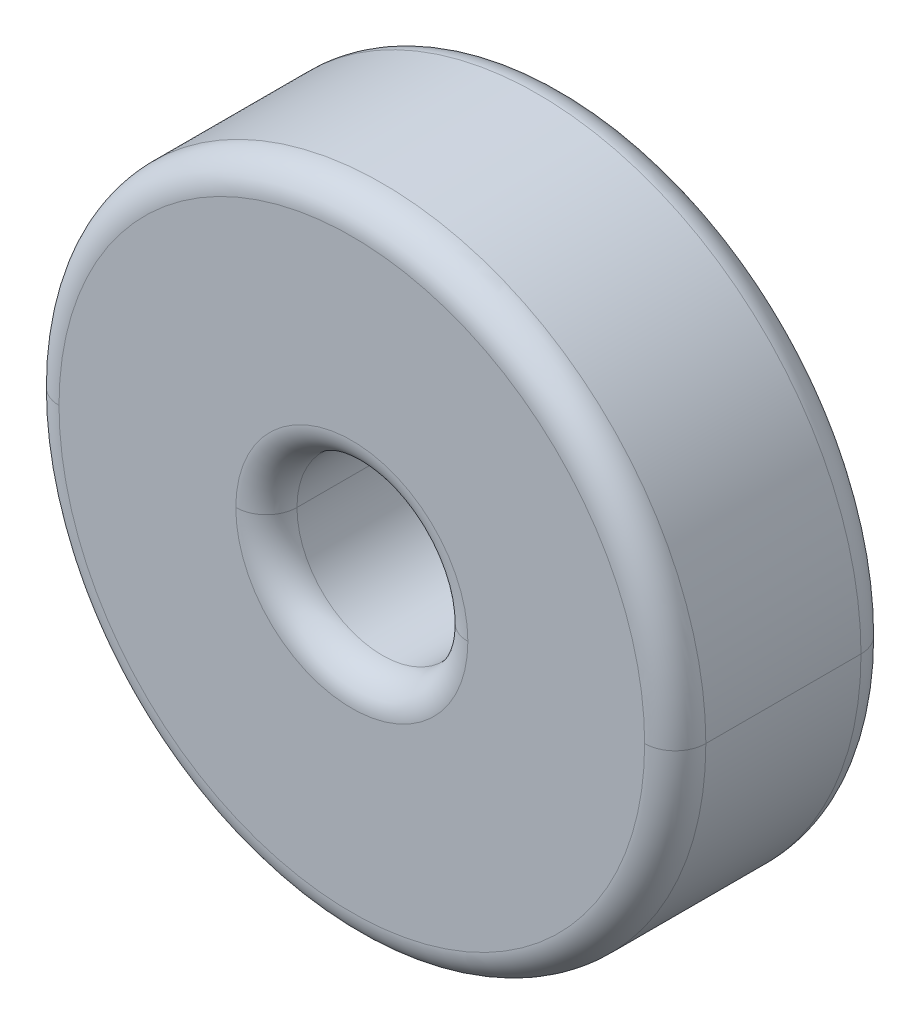
ISO-10303-21;
HEADER;
FILE_DESCRIPTION(('STEP AP214'),'2;1');
FILE_NAME('part.step','',(''),(''),'','','');
FILE_SCHEMA(('AUTOMOTIVE_DESIGN { 1 0 10303 214 1 1 1 1 }'));
ENDSEC;
DATA;
#1=APPLICATION_CONTEXT('core data for automotive mechanical design processes');
#2=APPLICATION_PROTOCOL_DEFINITION('international standard','automotive_design',2000,#1);
#3=PRODUCT_CONTEXT('',#1,'mechanical');
#4=PRODUCT('Part','Part','',(#3));
#5=PRODUCT_RELATED_PRODUCT_CATEGORY('part','',(#4));
#6=PRODUCT_DEFINITION_FORMATION('','',#4);
#7=PRODUCT_DEFINITION_CONTEXT('part definition',#1,'design');
#8=PRODUCT_DEFINITION('design','',#6,#7);
#9=PRODUCT_DEFINITION_SHAPE('','',#8);
#10=(LENGTH_UNIT() NAMED_UNIT(*) SI_UNIT(.MILLI.,.METRE.));
#11=(NAMED_UNIT(*) PLANE_ANGLE_UNIT() SI_UNIT($,.RADIAN.));
#12=(NAMED_UNIT(*) SI_UNIT($,.STERADIAN.) SOLID_ANGLE_UNIT());
#13=UNCERTAINTY_MEASURE_WITH_UNIT(LENGTH_MEASURE(1.E-05),#10,'distance_accuracy_value','');
#14=(GEOMETRIC_REPRESENTATION_CONTEXT(3) GLOBAL_UNCERTAINTY_ASSIGNED_CONTEXT((#13)) GLOBAL_UNIT_ASSIGNED_CONTEXT((#10,
#11,#12)) REPRESENTATION_CONTEXT('',''));
#15=CARTESIAN_POINT('',(0.,0.,0.));
#16=DIRECTION('',(0.,0.,1.));
#17=DIRECTION('',(1.,0.,0.));
#18=AXIS2_PLACEMENT_3D('',#15,#16,#17);
#19=CARTESIAN_POINT('',(0.,0.,5.));
#20=DIRECTION('',(0.,0.,1.));
#21=DIRECTION('',(1.,0.,0.));
#22=AXIS2_PLACEMENT_3D('',#19,#20,#21);
#23=CYLINDRICAL_SURFACE('',#22,1.975);
#24=DIRECTION('',(0.,0.,1.));
#25=VECTOR('',#24,1.);
#26=CARTESIAN_POINT('',(-1.975,0.,5.));
#27=LINE('',#26,#25);
#28=CARTESIAN_POINT('',(-1.975,0.,0.707106781186549));
#29=VERTEX_POINT('',#28);
#30=CARTESIAN_POINT('',(-1.975,0.,4.29289321881346));
#31=VERTEX_POINT('',#30);
#32=EDGE_CURVE('E107',#29,#31,#27,.T.);
#33=ORIENTED_EDGE('',*,*,#32,.F.);
#34=CARTESIAN_POINT('',(0.,0.,0.707106781186549));
#35=DIRECTION('',(0.,0.,1.));
#36=DIRECTION('',(1.,0.,0.));
#37=AXIS2_PLACEMENT_3D('',#34,#35,#36);
#38=CIRCLE('',#37,1.975);
#39=CARTESIAN_POINT('',(1.975,0.,0.707106781186549));
#40=VERTEX_POINT('',#39);
#41=EDGE_CURVE('E21',#40,#29,#38,.T.);
#42=ORIENTED_EDGE('',*,*,#41,.F.);
#43=DIRECTION('',(0.,0.,1.));
#44=VECTOR('',#43,1.);
#45=CARTESIAN_POINT('',(1.975,0.,5.));
#46=LINE('',#45,#44);
#47=CARTESIAN_POINT('',(1.975,0.,4.29289321881346));
#48=VERTEX_POINT('',#47);
#49=EDGE_CURVE('E110',#40,#48,#46,.T.);
#50=ORIENTED_EDGE('',*,*,#49,.T.);
#51=CARTESIAN_POINT('',(0.,0.,4.29289321881346));
#52=DIRECTION('',(0.,0.,1.));
#53=DIRECTION('',(1.,0.,0.));
#54=AXIS2_PLACEMENT_3D('',#51,#52,#53);
#55=CIRCLE('',#54,1.975);
#56=EDGE_CURVE('E103',#48,#31,#55,.T.);
#57=ORIENTED_EDGE('',*,*,#56,.T.);
#58=EDGE_LOOP('',(#33,#42,#50,#57));
#59=FACE_BOUND('',#58,.T.);
#60=ADVANCED_FACE('F17',(#59),#23,.F.);
#61=CARTESIAN_POINT('',(0.,0.,5.));
#62=DIRECTION('',(0.,0.,1.));
#63=DIRECTION('',(0.,-1.,0.));
#64=AXIS2_PLACEMENT_3D('',#61,#62,#63);
#65=PLANE('',#64);
#66=CARTESIAN_POINT('',(0.,0.,5.));
#67=DIRECTION('',(0.,0.,1.));
#68=DIRECTION('',(1.,0.,0.));
#69=AXIS2_PLACEMENT_3D('',#66,#67,#68);
#70=CIRCLE('',#69,2.68210678118655);
#71=CARTESIAN_POINT('',(2.68210678118655,0.,5.));
#72=VERTEX_POINT('',#71);
#73=CARTESIAN_POINT('',(-2.68210678118655,0.,5.));
#74=VERTEX_POINT('',#73);
#75=EDGE_CURVE('E123',#72,#74,#70,.T.);
#76=ORIENTED_EDGE('',*,*,#75,.F.);
#77=CARTESIAN_POINT('',(0.,0.,5.));
#78=DIRECTION('',(0.,0.,1.));
#79=DIRECTION('',(1.,0.,0.));
#80=AXIS2_PLACEMENT_3D('',#77,#78,#79);
#81=CIRCLE('',#80,2.68210678118655);
#82=EDGE_CURVE('E147',#74,#72,#81,.T.);
#83=ORIENTED_EDGE('',*,*,#82,.F.);
#84=EDGE_LOOP('',(#76,#83));
#85=FACE_BOUND('',#84,.T.);
#86=CARTESIAN_POINT('',(0.,0.,5.));
#87=DIRECTION('',(0.,0.,1.));
#88=DIRECTION('',(1.,0.,0.));
#89=AXIS2_PLACEMENT_3D('',#86,#87,#88);
#90=CIRCLE('',#89,6.76789321881345);
#91=CARTESIAN_POINT('',(6.76789321881345,0.,5.));
#92=VERTEX_POINT('',#91);
#93=CARTESIAN_POINT('',(-6.76789321881345,0.,5.));
#94=VERTEX_POINT('',#93);
#95=EDGE_CURVE('E180',#92,#94,#90,.T.);
#96=ORIENTED_EDGE('',*,*,#95,.T.);
#97=CARTESIAN_POINT('',(0.,0.,5.));
#98=DIRECTION('',(0.,0.,1.));
#99=DIRECTION('',(1.,0.,0.));
#100=AXIS2_PLACEMENT_3D('',#97,#98,#99);
#101=CIRCLE('',#100,6.76789321881345);
#102=EDGE_CURVE('E11',#94,#92,#101,.T.);
#103=ORIENTED_EDGE('',*,*,#102,.T.);
#104=EDGE_LOOP('',(#96,#103));
#105=FACE_BOUND('',#104,.T.);
#106=ADVANCED_FACE('F239',(#85,#105),#65,.T.);
#107=CARTESIAN_POINT('',(0.,0.,0.));
#108=DIRECTION('',(0.,0.,1.));
#109=DIRECTION('',(1.,0.,0.));
#110=AXIS2_PLACEMENT_3D('',#107,#108,#109);
#111=CYLINDRICAL_SURFACE('',#110,7.475);
#112=DIRECTION('',(0.,0.,1.));
#113=VECTOR('',#112,1.);
#114=CARTESIAN_POINT('',(-7.475,0.,0.));
#115=LINE('',#114,#113);
#116=CARTESIAN_POINT('',(-7.475,0.,0.70710678118655));
#117=VERTEX_POINT('',#116);
#118=CARTESIAN_POINT('',(-7.475,0.,4.29289321881346));
#119=VERTEX_POINT('',#118);
#120=EDGE_CURVE('E185',#117,#119,#115,.T.);
#121=ORIENTED_EDGE('',*,*,#120,.F.);
#122=CARTESIAN_POINT('',(0.,0.,0.707106781186549));
#123=DIRECTION('',(0.,0.,1.));
#124=DIRECTION('',(1.,0.,0.));
#125=AXIS2_PLACEMENT_3D('',#122,#123,#124);
#126=CIRCLE('',#125,7.475);
#127=CARTESIAN_POINT('',(7.475,0.,0.707106781186549));
#128=VERTEX_POINT('',#127);
#129=EDGE_CURVE('E146',#117,#128,#126,.T.);
#130=ORIENTED_EDGE('',*,*,#129,.T.);
#131=DIRECTION('',(0.,0.,1.));
#132=VECTOR('',#131,1.);
#133=CARTESIAN_POINT('',(7.475,0.,0.));
#134=LINE('',#133,#132);
#135=CARTESIAN_POINT('',(7.475,0.,4.29289321881346));
#136=VERTEX_POINT('',#135);
#137=EDGE_CURVE('E153',#128,#136,#134,.T.);
#138=ORIENTED_EDGE('',*,*,#137,.T.);
#139=CARTESIAN_POINT('',(0.,0.,4.29289321881346));
#140=DIRECTION('',(0.,0.,1.));
#141=DIRECTION('',(1.,0.,0.));
#142=AXIS2_PLACEMENT_3D('',#139,#140,#141);
#143=CIRCLE('',#142,7.475);
#144=EDGE_CURVE('E28',#119,#136,#143,.T.);
#145=ORIENTED_EDGE('',*,*,#144,.F.);
#146=EDGE_LOOP('',(#121,#130,#138,#145));
#147=FACE_BOUND('',#146,.T.);
#148=ADVANCED_FACE('F231',(#147),#111,.T.);
#149=CARTESIAN_POINT('',(0.,0.,0.));
#150=DIRECTION('',(0.,0.,-1.));
#151=DIRECTION('',(-1.,0.,0.));
#152=AXIS2_PLACEMENT_3D('',#149,#150,#151);
#153=PLANE('',#152);
#154=CARTESIAN_POINT('',(0.,0.,0.));
#155=DIRECTION('',(0.,0.,1.));
#156=DIRECTION('',(1.,0.,0.));
#157=AXIS2_PLACEMENT_3D('',#154,#155,#156);
#158=CIRCLE('',#157,2.68210678118655);
#159=CARTESIAN_POINT('',(2.68210678118655,0.,0.));
#160=VERTEX_POINT('',#159);
#161=CARTESIAN_POINT('',(-2.68210678118655,0.,0.));
#162=VERTEX_POINT('',#161);
#163=EDGE_CURVE('E151',#160,#162,#158,.T.);
#164=ORIENTED_EDGE('',*,*,#163,.T.);
#165=CARTESIAN_POINT('',(0.,0.,0.));
#166=DIRECTION('',(0.,0.,1.));
#167=DIRECTION('',(1.,0.,0.));
#168=AXIS2_PLACEMENT_3D('',#165,#166,#167);
#169=CIRCLE('',#168,2.68210678118655);
#170=EDGE_CURVE('E42',#162,#160,#169,.T.);
#171=ORIENTED_EDGE('',*,*,#170,.T.);
#172=EDGE_LOOP('',(#164,#171));
#173=FACE_BOUND('',#172,.T.);
#174=CARTESIAN_POINT('',(0.,0.,0.));
#175=DIRECTION('',(0.,0.,1.));
#176=DIRECTION('',(1.,0.,0.));
#177=AXIS2_PLACEMENT_3D('',#174,#175,#176);
#178=CIRCLE('',#177,6.76789321881345);
#179=CARTESIAN_POINT('',(6.76789321881345,0.,0.));
#180=VERTEX_POINT('',#179);
#181=CARTESIAN_POINT('',(-6.76789321881345,0.,0.));
#182=VERTEX_POINT('',#181);
#183=EDGE_CURVE('E164',#180,#182,#178,.T.);
#184=ORIENTED_EDGE('',*,*,#183,.F.);
#185=CARTESIAN_POINT('',(0.,0.,0.));
#186=DIRECTION('',(0.,0.,1.));
#187=DIRECTION('',(1.,0.,0.));
#188=AXIS2_PLACEMENT_3D('',#185,#186,#187);
#189=CIRCLE('',#188,6.76789321881345);
#190=EDGE_CURVE('E80',#182,#180,#189,.T.);
#191=ORIENTED_EDGE('',*,*,#190,.F.);
#192=EDGE_LOOP('',(#184,#191));
#193=FACE_BOUND('',#192,.T.);
#194=ADVANCED_FACE('F228',(#173,#193),#153,.T.);
#195=CARTESIAN_POINT('',(0.,0.,4.29289321881346));
#196=DIRECTION('',(0.,0.,1.));
#197=DIRECTION('',(1.,0.,0.));
#198=AXIS2_PLACEMENT_3D('',#195,#196,#197);
#199=TOROIDAL_SURFACE('',#198,6.76789321881345,0.707106781186547);
#200=CARTESIAN_POINT('',(-6.76789321881345,0.,4.29289321881346));
#201=DIRECTION('',(0.,1.,0.));
#202=DIRECTION('',(-1.,0.,0.));
#203=AXIS2_PLACEMENT_3D('',#200,#201,#202);
#204=CIRCLE('',#203,0.707106781186547);
#205=EDGE_CURVE('E157',#119,#94,#204,.T.);
#206=ORIENTED_EDGE('',*,*,#205,.F.);
#207=ORIENTED_EDGE('',*,*,#144,.T.);
#208=CARTESIAN_POINT('',(6.76789321881345,0.,4.29289321881346));
#209=DIRECTION('',(0.,-1.,0.));
#210=DIRECTION('',(0.,0.,-1.));
#211=AXIS2_PLACEMENT_3D('',#208,#209,#210);
#212=CIRCLE('',#211,0.707106781186547);
#213=EDGE_CURVE('E176',#136,#92,#212,.T.);
#214=ORIENTED_EDGE('',*,*,#213,.T.);
#215=ORIENTED_EDGE('',*,*,#102,.F.);
#216=EDGE_LOOP('',(#206,#207,#214,#215));
#217=FACE_BOUND('',#216,.T.);
#218=ADVANCED_FACE('F230',(#217),#199,.T.);
#219=CARTESIAN_POINT('',(0.,0.,0.707106781186549));
#220=DIRECTION('',(0.,0.,1.));
#221=DIRECTION('',(1.,0.,0.));
#222=AXIS2_PLACEMENT_3D('',#219,#220,#221);
#223=TOROIDAL_SURFACE('',#222,6.76789321881345,0.707106781186547);
#224=CARTESIAN_POINT('',(-6.76789321881345,0.,0.70710678118655));
#225=DIRECTION('',(0.,1.,0.));
#226=DIRECTION('',(-1.,0.,0.));
#227=AXIS2_PLACEMENT_3D('',#224,#225,#226);
#228=CIRCLE('',#227,0.707106781186547);
#229=EDGE_CURVE('E159',#182,#117,#228,.T.);
#230=ORIENTED_EDGE('',*,*,#229,.F.);
#231=ORIENTED_EDGE('',*,*,#190,.T.);
#232=CARTESIAN_POINT('',(6.76789321881345,0.,0.707106781186549));
#233=DIRECTION('',(0.,-1.,0.));
#234=DIRECTION('',(0.,0.,-1.));
#235=AXIS2_PLACEMENT_3D('',#232,#233,#234);
#236=CIRCLE('',#235,0.707106781186547);
#237=EDGE_CURVE('E163',#180,#128,#236,.T.);
#238=ORIENTED_EDGE('',*,*,#237,.T.);
#239=ORIENTED_EDGE('',*,*,#129,.F.);
#240=EDGE_LOOP('',(#230,#231,#238,#239));
#241=FACE_BOUND('',#240,.T.);
#242=ADVANCED_FACE('F19',(#241),#223,.T.);
#243=CARTESIAN_POINT('',(0.,0.,4.29289321881346));
#244=DIRECTION('',(0.,0.,1.));
#245=DIRECTION('',(1.,0.,0.));
#246=AXIS2_PLACEMENT_3D('',#243,#244,#245);
#247=TOROIDAL_SURFACE('',#246,2.68210678118655,0.707106781186547);
#248=CARTESIAN_POINT('',(-2.68210678118655,0.,4.29289321881346));
#249=DIRECTION('',(0.,1.,0.));
#250=DIRECTION('',(-1.,0.,0.));
#251=AXIS2_PLACEMENT_3D('',#248,#249,#250);
#252=CIRCLE('',#251,0.707106781186547);
#253=EDGE_CURVE('E116',#74,#31,#252,.T.);
#254=ORIENTED_EDGE('',*,*,#253,.F.);
#255=ORIENTED_EDGE('',*,*,#82,.T.);
#256=CARTESIAN_POINT('',(2.68210678118655,0.,4.29289321881346));
#257=DIRECTION('',(0.,-1.,0.));
#258=DIRECTION('',(0.,0.,-1.));
#259=AXIS2_PLACEMENT_3D('',#256,#257,#258);
#260=CIRCLE('',#259,0.707106781186547);
#261=EDGE_CURVE('E115',#72,#48,#260,.T.);
#262=ORIENTED_EDGE('',*,*,#261,.T.);
#263=CARTESIAN_POINT('',(0.,0.,4.29289321881346));
#264=DIRECTION('',(0.,0.,1.));
#265=DIRECTION('',(1.,0.,0.));
#266=AXIS2_PLACEMENT_3D('',#263,#264,#265);
#267=CIRCLE('',#266,1.975);
#268=EDGE_CURVE('E127',#31,#48,#267,.T.);
#269=ORIENTED_EDGE('',*,*,#268,.F.);
#270=EDGE_LOOP('',(#254,#255,#262,#269));
#271=FACE_BOUND('',#270,.T.);
#272=ADVANCED_FACE('F128',(#271),#247,.T.);
#273=CARTESIAN_POINT('',(0.,0.,0.707106781186549));
#274=DIRECTION('',(0.,0.,1.));
#275=DIRECTION('',(1.,0.,0.));
#276=AXIS2_PLACEMENT_3D('',#273,#274,#275);
#277=TOROIDAL_SURFACE('',#276,2.68210678118655,0.707106781186547);
#278=CARTESIAN_POINT('',(-2.68210678118655,0.,0.707106781186549));
#279=DIRECTION('',(0.,1.,0.));
#280=DIRECTION('',(-1.,0.,0.));
#281=AXIS2_PLACEMENT_3D('',#278,#279,#280);
#282=CIRCLE('',#281,0.707106781186547);
#283=EDGE_CURVE('E148',#29,#162,#282,.T.);
#284=ORIENTED_EDGE('',*,*,#283,.F.);
#285=CARTESIAN_POINT('',(0.,0.,0.707106781186549));
#286=DIRECTION('',(0.,0.,1.));
#287=DIRECTION('',(1.,0.,0.));
#288=AXIS2_PLACEMENT_3D('',#285,#286,#287);
#289=CIRCLE('',#288,1.975);
#290=EDGE_CURVE('E134',#29,#40,#289,.T.);
#291=ORIENTED_EDGE('',*,*,#290,.T.);
#292=CARTESIAN_POINT('',(2.68210678118655,0.,0.707106781186549));
#293=DIRECTION('',(0.,-1.,0.));
#294=DIRECTION('',(0.,0.,-1.));
#295=AXIS2_PLACEMENT_3D('',#292,#293,#294);
#296=CIRCLE('',#295,0.707106781186547);
#297=EDGE_CURVE('E175',#40,#160,#296,.T.);
#298=ORIENTED_EDGE('',*,*,#297,.T.);
#299=ORIENTED_EDGE('',*,*,#170,.F.);
#300=EDGE_LOOP('',(#284,#291,#298,#299));
#301=FACE_BOUND('',#300,.T.);
#302=ADVANCED_FACE('F260',(#301),#277,.T.);
#303=CARTESIAN_POINT('',(0.,0.,0.707106781186549));
#304=DIRECTION('',(0.,0.,1.));
#305=DIRECTION('',(1.,0.,0.));
#306=AXIS2_PLACEMENT_3D('',#303,#304,#305);
#307=TOROIDAL_SURFACE('',#306,2.68210678118655,0.707106781186547);
#308=ORIENTED_EDGE('',*,*,#41,.T.);
#309=ORIENTED_EDGE('',*,*,#283,.T.);
#310=ORIENTED_EDGE('',*,*,#163,.F.);
#311=ORIENTED_EDGE('',*,*,#297,.F.);
#312=EDGE_LOOP('',(#308,#309,#310,#311));
#313=FACE_BOUND('',#312,.T.);
#314=ADVANCED_FACE('F258',(#313),#307,.T.);
#315=CARTESIAN_POINT('',(0.,0.,4.29289321881346));
#316=DIRECTION('',(0.,0.,1.));
#317=DIRECTION('',(1.,0.,0.));
#318=AXIS2_PLACEMENT_3D('',#315,#316,#317);
#319=TOROIDAL_SURFACE('',#318,2.68210678118655,0.707106781186547);
#320=ORIENTED_EDGE('',*,*,#75,.T.);
#321=ORIENTED_EDGE('',*,*,#253,.T.);
#322=ORIENTED_EDGE('',*,*,#56,.F.);
#323=ORIENTED_EDGE('',*,*,#261,.F.);
#324=EDGE_LOOP('',(#320,#321,#322,#323));
#325=FACE_BOUND('',#324,.T.);
#326=ADVANCED_FACE('F121',(#325),#319,.T.);
#327=CARTESIAN_POINT('',(0.,0.,0.707106781186549));
#328=DIRECTION('',(0.,0.,1.));
#329=DIRECTION('',(1.,0.,0.));
#330=AXIS2_PLACEMENT_3D('',#327,#328,#329);
#331=TOROIDAL_SURFACE('',#330,6.76789321881345,0.707106781186547);
#332=ORIENTED_EDGE('',*,*,#183,.T.);
#333=ORIENTED_EDGE('',*,*,#229,.T.);
#334=CARTESIAN_POINT('',(0.,0.,0.707106781186549));
#335=DIRECTION('',(0.,0.,1.));
#336=DIRECTION('',(1.,0.,0.));
#337=AXIS2_PLACEMENT_3D('',#334,#335,#336);
#338=CIRCLE('',#337,7.475);
#339=EDGE_CURVE('E188',#128,#117,#338,.T.);
#340=ORIENTED_EDGE('',*,*,#339,.F.);
#341=ORIENTED_EDGE('',*,*,#237,.F.);
#342=EDGE_LOOP('',(#332,#333,#340,#341));
#343=FACE_BOUND('',#342,.T.);
#344=ADVANCED_FACE('F227',(#343),#331,.T.);
#345=CARTESIAN_POINT('',(0.,0.,4.29289321881346));
#346=DIRECTION('',(0.,0.,1.));
#347=DIRECTION('',(1.,0.,0.));
#348=AXIS2_PLACEMENT_3D('',#345,#346,#347);
#349=TOROIDAL_SURFACE('',#348,6.76789321881345,0.707106781186547);
#350=CARTESIAN_POINT('',(0.,0.,4.29289321881346));
#351=DIRECTION('',(0.,0.,1.));
#352=DIRECTION('',(1.,0.,0.));
#353=AXIS2_PLACEMENT_3D('',#350,#351,#352);
#354=CIRCLE('',#353,7.475);
#355=EDGE_CURVE('E158',#136,#119,#354,.T.);
#356=ORIENTED_EDGE('',*,*,#355,.T.);
#357=ORIENTED_EDGE('',*,*,#205,.T.);
#358=ORIENTED_EDGE('',*,*,#95,.F.);
#359=ORIENTED_EDGE('',*,*,#213,.F.);
#360=EDGE_LOOP('',(#356,#357,#358,#359));
#361=FACE_BOUND('',#360,.T.);
#362=ADVANCED_FACE('F252',(#361),#349,.T.);
#363=CARTESIAN_POINT('',(0.,0.,0.));
#364=DIRECTION('',(0.,0.,1.));
#365=DIRECTION('',(1.,0.,0.));
#366=AXIS2_PLACEMENT_3D('',#363,#364,#365);
#367=CYLINDRICAL_SURFACE('',#366,7.475);
#368=ORIENTED_EDGE('',*,*,#339,.T.);
#369=ORIENTED_EDGE('',*,*,#120,.T.);
#370=ORIENTED_EDGE('',*,*,#355,.F.);
#371=ORIENTED_EDGE('',*,*,#137,.F.);
#372=EDGE_LOOP('',(#368,#369,#370,#371));
#373=FACE_BOUND('',#372,.T.);
#374=ADVANCED_FACE('F255',(#373),#367,.T.);
#375=CARTESIAN_POINT('',(0.,0.,5.));
#376=DIRECTION('',(0.,0.,1.));
#377=DIRECTION('',(1.,0.,0.));
#378=AXIS2_PLACEMENT_3D('',#375,#376,#377);
#379=CYLINDRICAL_SURFACE('',#378,1.975);
#380=ORIENTED_EDGE('',*,*,#290,.F.);
#381=ORIENTED_EDGE('',*,*,#32,.T.);
#382=ORIENTED_EDGE('',*,*,#268,.T.);
#383=ORIENTED_EDGE('',*,*,#49,.F.);
#384=EDGE_LOOP('',(#380,#381,#382,#383));
#385=FACE_BOUND('',#384,.T.);
#386=ADVANCED_FACE('F132',(#385),#379,.F.);
#387=CLOSED_SHELL('',(#60,#106,#148,#194,#218,#242,#272,#302,#314,#326,#344,#362,#374,#386));
#388=MANIFOLD_SOLID_BREP('B1',#387);
#389=ADVANCED_BREP_SHAPE_REPRESENTATION('',(#18,#388),#14);
#390=SHAPE_DEFINITION_REPRESENTATION(#9,#389);
ENDSEC;
END-ISO-10303-21;
